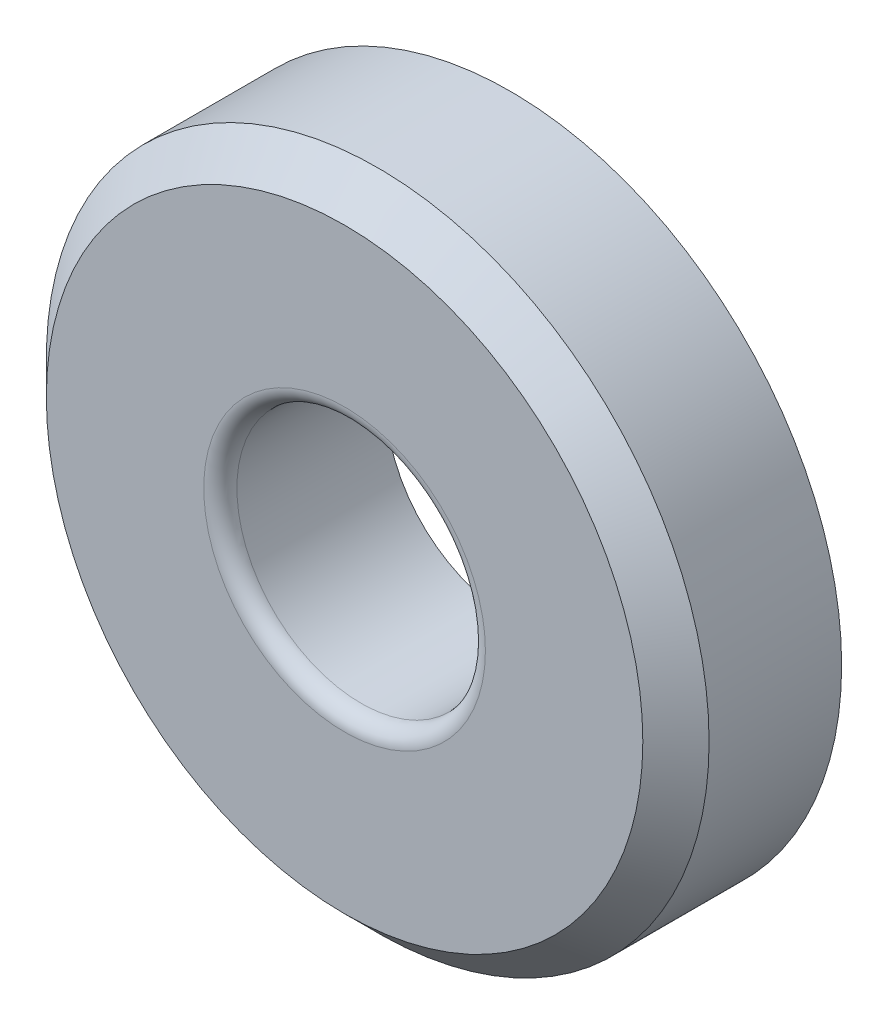
ISO-10303-21;
HEADER;
FILE_DESCRIPTION(('STEP AP214'),'2;1');
FILE_NAME('part.step','',(''),(''),'','','');
FILE_SCHEMA(('AUTOMOTIVE_DESIGN { 1 0 10303 214 1 1 1 1 }'));
ENDSEC;
DATA;
#1=APPLICATION_CONTEXT('core data for automotive mechanical design processes');
#2=APPLICATION_PROTOCOL_DEFINITION('international standard','automotive_design',2000,#1);
#3=PRODUCT_CONTEXT('',#1,'mechanical');
#4=PRODUCT('Part','Part','',(#3));
#5=PRODUCT_RELATED_PRODUCT_CATEGORY('part','',(#4));
#6=PRODUCT_DEFINITION_FORMATION('','',#4);
#7=PRODUCT_DEFINITION_CONTEXT('part definition',#1,'design');
#8=PRODUCT_DEFINITION('design','',#6,#7);
#9=PRODUCT_DEFINITION_SHAPE('','',#8);
#10=(LENGTH_UNIT() NAMED_UNIT(*) SI_UNIT(.MILLI.,.METRE.));
#11=(NAMED_UNIT(*) PLANE_ANGLE_UNIT() SI_UNIT($,.RADIAN.));
#12=(NAMED_UNIT(*) SI_UNIT($,.STERADIAN.) SOLID_ANGLE_UNIT());
#13=UNCERTAINTY_MEASURE_WITH_UNIT(LENGTH_MEASURE(1.E-05),#10,'distance_accuracy_value','');
#14=(GEOMETRIC_REPRESENTATION_CONTEXT(3) GLOBAL_UNCERTAINTY_ASSIGNED_CONTEXT((#13)) GLOBAL_UNIT_ASSIGNED_CONTEXT((#10,
#11,#12)) REPRESENTATION_CONTEXT('',''));
#15=CARTESIAN_POINT('',(0.,0.,0.));
#16=DIRECTION('',(0.,0.,1.));
#17=DIRECTION('',(1.,0.,0.));
#18=AXIS2_PLACEMENT_3D('',#15,#16,#17);
#19=CARTESIAN_POINT('',(0.,0.,12.7));
#20=DIRECTION('',(0.,0.,1.));
#21=DIRECTION('',(1.,0.,0.));
#22=AXIS2_PLACEMENT_3D('',#19,#20,#21);
#23=PLANE('',#22);
#24=CARTESIAN_POINT('',(0.,0.,12.7));
#25=DIRECTION('',(0.,0.,1.));
#26=DIRECTION('',(1.,0.,0.));
#27=AXIS2_PLACEMENT_3D('',#24,#25,#26);
#28=CIRCLE('',#27,10.795);
#29=CARTESIAN_POINT('',(10.795,0.,12.7));
#30=VERTEX_POINT('',#29);
#31=EDGE_CURVE('E10',#30,#30,#28,.F.);
#32=ORIENTED_EDGE('',*,*,#31,.T.);
#33=EDGE_LOOP('',(#32));
#34=FACE_BOUND('',#33,.T.);
#35=CARTESIAN_POINT('',(0.,0.,12.7));
#36=DIRECTION('',(0.,0.,1.));
#37=DIRECTION('',(1.,0.,0.));
#38=AXIS2_PLACEMENT_3D('',#35,#36,#37);
#39=CIRCLE('',#38,22.86);
#40=CARTESIAN_POINT('',(22.86,0.,12.7));
#41=VERTEX_POINT('',#40);
#42=EDGE_CURVE('E55',#41,#41,#39,.T.);
#43=ORIENTED_EDGE('',*,*,#42,.T.);
#44=EDGE_LOOP('',(#43));
#45=FACE_BOUND('',#44,.T.);
#46=ADVANCED_FACE('F34',(#34,#45),#23,.T.);
#47=CARTESIAN_POINT('',(0.,0.,0.));
#48=DIRECTION('',(0.,0.,1.));
#49=DIRECTION('',(1.,0.,0.));
#50=AXIS2_PLACEMENT_3D('',#47,#48,#49);
#51=PLANE('',#50);
#52=CARTESIAN_POINT('',(0.,0.,0.));
#53=DIRECTION('',(0.,0.,1.));
#54=DIRECTION('',(1.,0.,0.));
#55=AXIS2_PLACEMENT_3D('',#52,#53,#54);
#56=CIRCLE('',#55,25.4);
#57=CARTESIAN_POINT('',(25.4,0.,0.));
#58=VERTEX_POINT('',#57);
#59=EDGE_CURVE('E61',#58,#58,#56,.T.);
#60=ORIENTED_EDGE('',*,*,#59,.F.);
#61=EDGE_LOOP('',(#60));
#62=FACE_BOUND('',#61,.T.);
#63=CARTESIAN_POINT('',(0.,0.,0.));
#64=DIRECTION('',(0.,0.,1.));
#65=DIRECTION('',(1.,0.,0.));
#66=AXIS2_PLACEMENT_3D('',#63,#64,#65);
#67=CIRCLE('',#66,9.525);
#68=CARTESIAN_POINT('',(9.525,0.,0.));
#69=VERTEX_POINT('',#68);
#70=EDGE_CURVE('E65',#69,#69,#67,.T.);
#71=ORIENTED_EDGE('',*,*,#70,.T.);
#72=EDGE_LOOP('',(#71));
#73=FACE_BOUND('',#72,.T.);
#74=ADVANCED_FACE('F71',(#62,#73),#51,.F.);
#75=CARTESIAN_POINT('',(0.,0.,12.7));
#76=DIRECTION('',(0.,0.,-1.));
#77=DIRECTION('',(-1.,0.,0.));
#78=AXIS2_PLACEMENT_3D('',#75,#76,#77);
#79=CYLINDRICAL_SURFACE('',#78,25.4);
#80=CARTESIAN_POINT('',(0.,0.,10.16));
#81=DIRECTION('',(0.,0.,1.));
#82=DIRECTION('',(1.,0.,0.));
#83=AXIS2_PLACEMENT_3D('',#80,#81,#82);
#84=CIRCLE('',#83,25.4);
#85=CARTESIAN_POINT('',(25.4,0.,10.16));
#86=VERTEX_POINT('',#85);
#87=EDGE_CURVE('E49',#86,#86,#84,.F.);
#88=ORIENTED_EDGE('',*,*,#87,.T.);
#89=EDGE_LOOP('',(#88));
#90=FACE_BOUND('',#89,.T.);
#91=ORIENTED_EDGE('',*,*,#59,.T.);
#92=EDGE_LOOP('',(#91));
#93=FACE_BOUND('',#92,.T.);
#94=ADVANCED_FACE('F76',(#90,#93),#79,.T.);
#95=CARTESIAN_POINT('',(0.,0.,12.7));
#96=DIRECTION('',(0.,0.,-1.));
#97=DIRECTION('',(-1.,0.,0.));
#98=AXIS2_PLACEMENT_3D('',#95,#96,#97);
#99=CYLINDRICAL_SURFACE('',#98,9.525);
#100=CARTESIAN_POINT('',(0.,0.,11.43));
#101=DIRECTION('',(0.,0.,1.));
#102=DIRECTION('',(1.,0.,0.));
#103=AXIS2_PLACEMENT_3D('',#100,#101,#102);
#104=CIRCLE('',#103,9.525);
#105=CARTESIAN_POINT('',(9.525,0.,11.43));
#106=VERTEX_POINT('',#105);
#107=EDGE_CURVE('E42',#106,#106,#104,.T.);
#108=ORIENTED_EDGE('',*,*,#107,.T.);
#109=EDGE_LOOP('',(#108));
#110=FACE_BOUND('',#109,.T.);
#111=ORIENTED_EDGE('',*,*,#70,.F.);
#112=EDGE_LOOP('',(#111));
#113=FACE_BOUND('',#112,.T.);
#114=ADVANCED_FACE('F73',(#110,#113),#99,.F.);
#115=CARTESIAN_POINT('',(0.,0.,12.7));
#116=DIRECTION('',(0.,0.,-1.));
#117=DIRECTION('',(-1.,0.,0.));
#118=AXIS2_PLACEMENT_3D('',#115,#116,#117);
#119=CONICAL_SURFACE('',#118,22.86,0.785398163397446);
#120=ORIENTED_EDGE('',*,*,#87,.F.);
#121=EDGE_LOOP('',(#120));
#122=FACE_BOUND('',#121,.T.);
#123=ORIENTED_EDGE('',*,*,#42,.F.);
#124=EDGE_LOOP('',(#123));
#125=FACE_BOUND('',#124,.T.);
#126=ADVANCED_FACE('F75',(#122,#125),#119,.T.);
#127=CARTESIAN_POINT('',(0.,0.,11.43));
#128=DIRECTION('',(0.,0.,1.));
#129=DIRECTION('',(1.,0.,0.));
#130=AXIS2_PLACEMENT_3D('',#127,#128,#129);
#131=TOROIDAL_SURFACE('',#130,10.795,1.27);
#132=ORIENTED_EDGE('',*,*,#31,.F.);
#133=EDGE_LOOP('',(#132));
#134=FACE_BOUND('',#133,.T.);
#135=ORIENTED_EDGE('',*,*,#107,.F.);
#136=EDGE_LOOP('',(#135));
#137=FACE_BOUND('',#136,.T.);
#138=ADVANCED_FACE('F36',(#134,#137),#131,.T.);
#139=CLOSED_SHELL('',(#46,#74,#94,#114,#126,#138));
#140=MANIFOLD_SOLID_BREP('B2',#139);
#141=ADVANCED_BREP_SHAPE_REPRESENTATION('',(#18,#140),#14);
#142=SHAPE_DEFINITION_REPRESENTATION(#9,#141);
ENDSEC;
END-ISO-10303-21;
